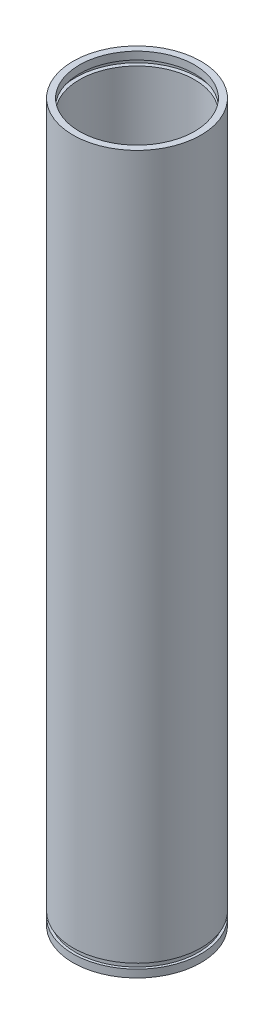
ISO-10303-21;
HEADER;
FILE_DESCRIPTION(('STEP AP214'),'2;1');
FILE_NAME('part.step','',(''),(''),'','','');
FILE_SCHEMA(('AUTOMOTIVE_DESIGN { 1 0 10303 214 1 1 1 1 }'));
ENDSEC;
DATA;
#1=APPLICATION_CONTEXT('core data for automotive mechanical design processes');
#2=APPLICATION_PROTOCOL_DEFINITION('international standard','automotive_design',2000,#1);
#3=PRODUCT_CONTEXT('',#1,'mechanical');
#4=PRODUCT('Part','Part','',(#3));
#5=PRODUCT_RELATED_PRODUCT_CATEGORY('part','',(#4));
#6=PRODUCT_DEFINITION_FORMATION('','',#4);
#7=PRODUCT_DEFINITION_CONTEXT('part definition',#1,'design');
#8=PRODUCT_DEFINITION('design','',#6,#7);
#9=PRODUCT_DEFINITION_SHAPE('','',#8);
#10=(LENGTH_UNIT() NAMED_UNIT(*) SI_UNIT(.MILLI.,.METRE.));
#11=(NAMED_UNIT(*) PLANE_ANGLE_UNIT() SI_UNIT($,.RADIAN.));
#12=(NAMED_UNIT(*) SI_UNIT($,.STERADIAN.) SOLID_ANGLE_UNIT());
#13=UNCERTAINTY_MEASURE_WITH_UNIT(LENGTH_MEASURE(1.E-05),#10,'distance_accuracy_value','');
#14=(GEOMETRIC_REPRESENTATION_CONTEXT(3) GLOBAL_UNCERTAINTY_ASSIGNED_CONTEXT((#13)) GLOBAL_UNIT_ASSIGNED_CONTEXT((#10,
#11,#12)) REPRESENTATION_CONTEXT('',''));
#15=CARTESIAN_POINT('',(0.,0.,0.));
#16=DIRECTION('',(0.,0.,1.));
#17=DIRECTION('',(1.,0.,0.));
#18=AXIS2_PLACEMENT_3D('',#15,#16,#17);
#19=CARTESIAN_POINT('',(0.,280.,0.));
#20=DIRECTION('',(0.,-1.,0.));
#21=DIRECTION('',(0.,0.,-1.));
#22=AXIS2_PLACEMENT_3D('',#19,#20,#21);
#23=CYLINDRICAL_SURFACE('',#22,25.);
#24=CARTESIAN_POINT('',(0.,0.,0.));
#25=DIRECTION('',(0.,1.,0.));
#26=DIRECTION('',(0.,0.,1.));
#27=AXIS2_PLACEMENT_3D('',#24,#25,#26);
#28=CIRCLE('',#27,25.);
#29=CARTESIAN_POINT('',(0.,0.,25.));
#30=VERTEX_POINT('',#29);
#31=EDGE_CURVE('E39',#30,#30,#28,.T.);
#32=ORIENTED_EDGE('',*,*,#31,.T.);
#33=EDGE_LOOP('',(#32));
#34=FACE_BOUND('',#33,.T.);
#35=CARTESIAN_POINT('',(0.,3.,0.));
#36=DIRECTION('',(0.,1.,0.));
#37=DIRECTION('',(0.,0.,1.));
#38=AXIS2_PLACEMENT_3D('',#35,#36,#37);
#39=CIRCLE('',#38,25.);
#40=CARTESIAN_POINT('',(0.,3.,25.));
#41=VERTEX_POINT('',#40);
#42=EDGE_CURVE('E35',#41,#41,#39,.T.);
#43=ORIENTED_EDGE('',*,*,#42,.F.);
#44=EDGE_LOOP('',(#43));
#45=FACE_BOUND('',#44,.T.);
#46=ADVANCED_FACE('F32',(#34,#45),#23,.T.);
#47=CARTESIAN_POINT('',(0.,280.,0.));
#48=DIRECTION('',(0.,1.,0.));
#49=DIRECTION('',(0.,0.,1.));
#50=AXIS2_PLACEMENT_3D('',#47,#48,#49);
#51=CIRCLE('',#50,25.);
#52=CARTESIAN_POINT('',(0.,280.,25.));
#53=VERTEX_POINT('',#52);
#54=EDGE_CURVE('E10',#53,#53,#51,.T.);
#55=ORIENTED_EDGE('',*,*,#54,.F.);
#56=EDGE_LOOP('',(#55));
#57=FACE_BOUND('',#56,.T.);
#58=CARTESIAN_POINT('',(0.,5.,0.));
#59=DIRECTION('',(0.,-1.,0.));
#60=DIRECTION('',(0.,0.,-1.));
#61=AXIS2_PLACEMENT_3D('',#58,#59,#60);
#62=CIRCLE('',#61,25.);
#63=CARTESIAN_POINT('',(0.,5.,-25.));
#64=VERTEX_POINT('',#63);
#65=EDGE_CURVE('E64',#64,#64,#62,.T.);
#66=ORIENTED_EDGE('',*,*,#65,.F.);
#67=EDGE_LOOP('',(#66));
#68=FACE_BOUND('',#67,.T.);
#69=ADVANCED_FACE('F98',(#57,#68),#23,.T.);
#70=CARTESIAN_POINT('',(0.,280.,0.));
#71=DIRECTION('',(0.,-1.,0.));
#72=DIRECTION('',(0.,0.,-1.));
#73=AXIS2_PLACEMENT_3D('',#70,#71,#72);
#74=CYLINDRICAL_SURFACE('',#73,22.5);
#75=CARTESIAN_POINT('',(0.,0.,0.));
#76=DIRECTION('',(0.,1.,0.));
#77=DIRECTION('',(0.,0.,1.));
#78=AXIS2_PLACEMENT_3D('',#75,#76,#77);
#79=CIRCLE('',#78,22.5);
#80=CARTESIAN_POINT('',(0.,0.,22.5));
#81=VERTEX_POINT('',#80);
#82=EDGE_CURVE('E47',#81,#81,#79,.T.);
#83=ORIENTED_EDGE('',*,*,#82,.F.);
#84=EDGE_LOOP('',(#83));
#85=FACE_BOUND('',#84,.T.);
#86=CARTESIAN_POINT('',(0.,8.00000000000001,0.));
#87=DIRECTION('',(0.,1.,0.));
#88=DIRECTION('',(0.,0.,1.));
#89=AXIS2_PLACEMENT_3D('',#86,#87,#88);
#90=CIRCLE('',#89,22.5);
#91=CARTESIAN_POINT('',(0.,8.00000000000001,22.5));
#92=VERTEX_POINT('',#91);
#93=EDGE_CURVE('E60',#92,#92,#90,.T.);
#94=ORIENTED_EDGE('',*,*,#93,.T.);
#95=EDGE_LOOP('',(#94));
#96=FACE_BOUND('',#95,.T.);
#97=ADVANCED_FACE('F94',(#85,#96),#74,.F.);
#98=CARTESIAN_POINT('',(0.,275.,0.));
#99=DIRECTION('',(0.,1.,0.));
#100=DIRECTION('',(0.,0.,1.));
#101=AXIS2_PLACEMENT_3D('',#98,#99,#100);
#102=CIRCLE('',#101,22.5);
#103=CARTESIAN_POINT('',(0.,275.,22.5));
#104=VERTEX_POINT('',#103);
#105=EDGE_CURVE('E53',#104,#104,#102,.T.);
#106=ORIENTED_EDGE('',*,*,#105,.T.);
#107=EDGE_LOOP('',(#106));
#108=FACE_BOUND('',#107,.T.);
#109=CARTESIAN_POINT('',(0.,10.,0.));
#110=DIRECTION('',(0.,-1.,0.));
#111=DIRECTION('',(0.,0.,-1.));
#112=AXIS2_PLACEMENT_3D('',#109,#110,#111);
#113=CIRCLE('',#112,22.5);
#114=CARTESIAN_POINT('',(0.,10.,-22.5));
#115=VERTEX_POINT('',#114);
#116=EDGE_CURVE('E57',#115,#115,#113,.T.);
#117=ORIENTED_EDGE('',*,*,#116,.T.);
#118=EDGE_LOOP('',(#117));
#119=FACE_BOUND('',#118,.T.);
#120=ADVANCED_FACE('F97',(#108,#119),#74,.F.);
#121=CARTESIAN_POINT('',(0.,280.,0.));
#122=DIRECTION('',(0.,1.,0.));
#123=DIRECTION('',(0.,0.,1.));
#124=AXIS2_PLACEMENT_3D('',#121,#122,#123);
#125=CIRCLE('',#124,22.5);
#126=CARTESIAN_POINT('',(0.,280.,22.5));
#127=VERTEX_POINT('',#126);
#128=EDGE_CURVE('E44',#127,#127,#125,.T.);
#129=ORIENTED_EDGE('',*,*,#128,.T.);
#130=EDGE_LOOP('',(#129));
#131=FACE_BOUND('',#130,.T.);
#132=CARTESIAN_POINT('',(0.,277.,0.));
#133=DIRECTION('',(0.,-1.,0.));
#134=DIRECTION('',(0.,0.,-1.));
#135=AXIS2_PLACEMENT_3D('',#132,#133,#134);
#136=CIRCLE('',#135,22.5);
#137=CARTESIAN_POINT('',(0.,277.,-22.5));
#138=VERTEX_POINT('',#137);
#139=EDGE_CURVE('E50',#138,#138,#136,.T.);
#140=ORIENTED_EDGE('',*,*,#139,.T.);
#141=EDGE_LOOP('',(#140));
#142=FACE_BOUND('',#141,.T.);
#143=ADVANCED_FACE('F100',(#131,#142),#74,.F.);
#144=CARTESIAN_POINT('',(0.,280.,0.));
#145=DIRECTION('',(0.,1.,0.));
#146=DIRECTION('',(0.,0.,1.));
#147=AXIS2_PLACEMENT_3D('',#144,#145,#146);
#148=PLANE('',#147);
#149=ORIENTED_EDGE('',*,*,#54,.T.);
#150=EDGE_LOOP('',(#149));
#151=FACE_BOUND('',#150,.T.);
#152=ORIENTED_EDGE('',*,*,#128,.F.);
#153=EDGE_LOOP('',(#152));
#154=FACE_BOUND('',#153,.T.);
#155=ADVANCED_FACE('F214',(#151,#154),#148,.T.);
#156=CARTESIAN_POINT('',(0.,0.,0.));
#157=DIRECTION('',(0.,1.,0.));
#158=DIRECTION('',(0.,0.,1.));
#159=AXIS2_PLACEMENT_3D('',#156,#157,#158);
#160=PLANE('',#159);
#161=ORIENTED_EDGE('',*,*,#31,.F.);
#162=EDGE_LOOP('',(#161));
#163=FACE_BOUND('',#162,.T.);
#164=ORIENTED_EDGE('',*,*,#82,.T.);
#165=EDGE_LOOP('',(#164));
#166=FACE_BOUND('',#165,.T.);
#167=ADVANCED_FACE('F92',(#163,#166),#160,.F.);
#168=CARTESIAN_POINT('',(24.,275.,0.));
#169=DIRECTION('',(0.,1.,0.));
#170=DIRECTION('',(0.,0.,1.));
#171=AXIS2_PLACEMENT_3D('',#168,#169,#170);
#172=PLANE('',#171);
#173=ORIENTED_EDGE('',*,*,#105,.F.);
#174=EDGE_LOOP('',(#173));
#175=FACE_BOUND('',#174,.T.);
#176=CARTESIAN_POINT('',(0.,275.,0.));
#177=DIRECTION('',(0.,1.,0.));
#178=DIRECTION('',(0.,0.,1.));
#179=AXIS2_PLACEMENT_3D('',#176,#177,#178);
#180=CIRCLE('',#179,24.);
#181=CARTESIAN_POINT('',(0.,275.,24.));
#182=VERTEX_POINT('',#181);
#183=EDGE_CURVE('E54',#182,#182,#180,.T.);
#184=ORIENTED_EDGE('',*,*,#183,.T.);
#185=EDGE_LOOP('',(#184));
#186=FACE_BOUND('',#185,.T.);
#187=ADVANCED_FACE('F193',(#175,#186),#172,.T.);
#188=CARTESIAN_POINT('',(0.,307.215004670256,0.));
#189=DIRECTION('',(0.,1.,0.));
#190=DIRECTION('',(0.,0.,1.));
#191=AXIS2_PLACEMENT_3D('',#188,#189,#190);
#192=CYLINDRICAL_SURFACE('',#191,24.);
#193=CARTESIAN_POINT('',(0.,277.,0.));
#194=DIRECTION('',(0.,1.,0.));
#195=DIRECTION('',(0.,0.,1.));
#196=AXIS2_PLACEMENT_3D('',#193,#194,#195);
#197=CIRCLE('',#196,24.);
#198=CARTESIAN_POINT('',(0.,277.,24.));
#199=VERTEX_POINT('',#198);
#200=EDGE_CURVE('E63',#199,#199,#197,.T.);
#201=ORIENTED_EDGE('',*,*,#200,.T.);
#202=EDGE_LOOP('',(#201));
#203=FACE_BOUND('',#202,.T.);
#204=ORIENTED_EDGE('',*,*,#183,.F.);
#205=EDGE_LOOP('',(#204));
#206=FACE_BOUND('',#205,.T.);
#207=ADVANCED_FACE('F182',(#203,#206),#192,.F.);
#208=CARTESIAN_POINT('',(22.5,277.,0.));
#209=DIRECTION('',(0.,-1.,0.));
#210=DIRECTION('',(0.,0.,-1.));
#211=AXIS2_PLACEMENT_3D('',#208,#209,#210);
#212=PLANE('',#211);
#213=ORIENTED_EDGE('',*,*,#139,.F.);
#214=EDGE_LOOP('',(#213));
#215=FACE_BOUND('',#214,.T.);
#216=ORIENTED_EDGE('',*,*,#200,.F.);
#217=EDGE_LOOP('',(#216));
#218=FACE_BOUND('',#217,.T.);
#219=ADVANCED_FACE('F107',(#215,#218),#212,.T.);
#220=CARTESIAN_POINT('',(22.5,8.,0.));
#221=DIRECTION('',(0.,1.,0.));
#222=DIRECTION('',(0.,0.,1.));
#223=AXIS2_PLACEMENT_3D('',#220,#221,#222);
#224=PLANE('',#223);
#225=ORIENTED_EDGE('',*,*,#93,.F.);
#226=EDGE_LOOP('',(#225));
#227=FACE_BOUND('',#226,.T.);
#228=CARTESIAN_POINT('',(0.,8.00000000000001,0.));
#229=DIRECTION('',(0.,1.,0.));
#230=DIRECTION('',(0.,0.,1.));
#231=AXIS2_PLACEMENT_3D('',#228,#229,#230);
#232=CIRCLE('',#231,24.);
#233=CARTESIAN_POINT('',(0.,8.00000000000001,24.));
#234=VERTEX_POINT('',#233);
#235=EDGE_CURVE('E61',#234,#234,#232,.T.);
#236=ORIENTED_EDGE('',*,*,#235,.T.);
#237=EDGE_LOOP('',(#236));
#238=FACE_BOUND('',#237,.T.);
#239=ADVANCED_FACE('F103',(#227,#238),#224,.T.);
#240=CARTESIAN_POINT('',(0.,307.215004670256,0.));
#241=DIRECTION('',(0.,1.,0.));
#242=DIRECTION('',(0.,0.,1.));
#243=AXIS2_PLACEMENT_3D('',#240,#241,#242);
#244=CYLINDRICAL_SURFACE('',#243,24.);
#245=CARTESIAN_POINT('',(0.,10.,0.));
#246=DIRECTION('',(0.,1.,0.));
#247=DIRECTION('',(0.,0.,1.));
#248=AXIS2_PLACEMENT_3D('',#245,#246,#247);
#249=CIRCLE('',#248,24.);
#250=CARTESIAN_POINT('',(0.,10.,24.));
#251=VERTEX_POINT('',#250);
#252=EDGE_CURVE('E70',#251,#251,#249,.T.);
#253=ORIENTED_EDGE('',*,*,#252,.T.);
#254=EDGE_LOOP('',(#253));
#255=FACE_BOUND('',#254,.T.);
#256=ORIENTED_EDGE('',*,*,#235,.F.);
#257=EDGE_LOOP('',(#256));
#258=FACE_BOUND('',#257,.T.);
#259=ADVANCED_FACE('F106',(#255,#258),#244,.F.);
#260=CARTESIAN_POINT('',(24.,10.,0.));
#261=DIRECTION('',(0.,-1.,0.));
#262=DIRECTION('',(0.,0.,-1.));
#263=AXIS2_PLACEMENT_3D('',#260,#261,#262);
#264=PLANE('',#263);
#265=ORIENTED_EDGE('',*,*,#116,.F.);
#266=EDGE_LOOP('',(#265));
#267=FACE_BOUND('',#266,.T.);
#268=ORIENTED_EDGE('',*,*,#252,.F.);
#269=EDGE_LOOP('',(#268));
#270=FACE_BOUND('',#269,.T.);
#271=ADVANCED_FACE('F112',(#267,#270),#264,.T.);
#272=CARTESIAN_POINT('',(25.,3.,0.));
#273=DIRECTION('',(0.,1.,0.));
#274=DIRECTION('',(0.,0.,1.));
#275=AXIS2_PLACEMENT_3D('',#272,#273,#274);
#276=PLANE('',#275);
#277=CARTESIAN_POINT('',(0.,3.,0.));
#278=DIRECTION('',(0.,1.,0.));
#279=DIRECTION('',(0.,0.,1.));
#280=AXIS2_PLACEMENT_3D('',#277,#278,#279);
#281=CIRCLE('',#280,24.);
#282=CARTESIAN_POINT('',(0.,3.,24.));
#283=VERTEX_POINT('',#282);
#284=EDGE_CURVE('E66',#283,#283,#281,.T.);
#285=ORIENTED_EDGE('',*,*,#284,.F.);
#286=EDGE_LOOP('',(#285));
#287=FACE_BOUND('',#286,.T.);
#288=ORIENTED_EDGE('',*,*,#42,.T.);
#289=EDGE_LOOP('',(#288));
#290=FACE_BOUND('',#289,.T.);
#291=ADVANCED_FACE('F118',(#287,#290),#276,.T.);
#292=CARTESIAN_POINT('',(24.,5.,0.));
#293=DIRECTION('',(0.,-1.,0.));
#294=DIRECTION('',(0.,0.,-1.));
#295=AXIS2_PLACEMENT_3D('',#292,#293,#294);
#296=PLANE('',#295);
#297=CARTESIAN_POINT('',(0.,5.,0.));
#298=DIRECTION('',(0.,1.,0.));
#299=DIRECTION('',(0.,0.,1.));
#300=AXIS2_PLACEMENT_3D('',#297,#298,#299);
#301=CIRCLE('',#300,24.);
#302=CARTESIAN_POINT('',(0.,5.,24.));
#303=VERTEX_POINT('',#302);
#304=EDGE_CURVE('E72',#303,#303,#301,.T.);
#305=ORIENTED_EDGE('',*,*,#304,.T.);
#306=EDGE_LOOP('',(#305));
#307=FACE_BOUND('',#306,.T.);
#308=ORIENTED_EDGE('',*,*,#65,.T.);
#309=EDGE_LOOP('',(#308));
#310=FACE_BOUND('',#309,.T.);
#311=ADVANCED_FACE('F132',(#307,#310),#296,.T.);
#312=CARTESIAN_POINT('',(0.,307.215004670256,0.));
#313=DIRECTION('',(0.,1.,0.));
#314=DIRECTION('',(0.,0.,1.));
#315=AXIS2_PLACEMENT_3D('',#312,#313,#314);
#316=CYLINDRICAL_SURFACE('',#315,24.);
#317=ORIENTED_EDGE('',*,*,#284,.T.);
#318=EDGE_LOOP('',(#317));
#319=FACE_BOUND('',#318,.T.);
#320=ORIENTED_EDGE('',*,*,#304,.F.);
#321=EDGE_LOOP('',(#320));
#322=FACE_BOUND('',#321,.T.);
#323=ADVANCED_FACE('F138',(#319,#322),#316,.T.);
#324=CLOSED_SHELL('',(#46,#69,#97,#120,#143,#155,#167,#187,#207,#219,#239,#259,#271,#291,#311,#323));
#325=MANIFOLD_SOLID_BREP('B2',#324);
#326=ADVANCED_BREP_SHAPE_REPRESENTATION('',(#18,#325),#14);
#327=SHAPE_DEFINITION_REPRESENTATION(#9,#326);
ENDSEC;
END-ISO-10303-21;
